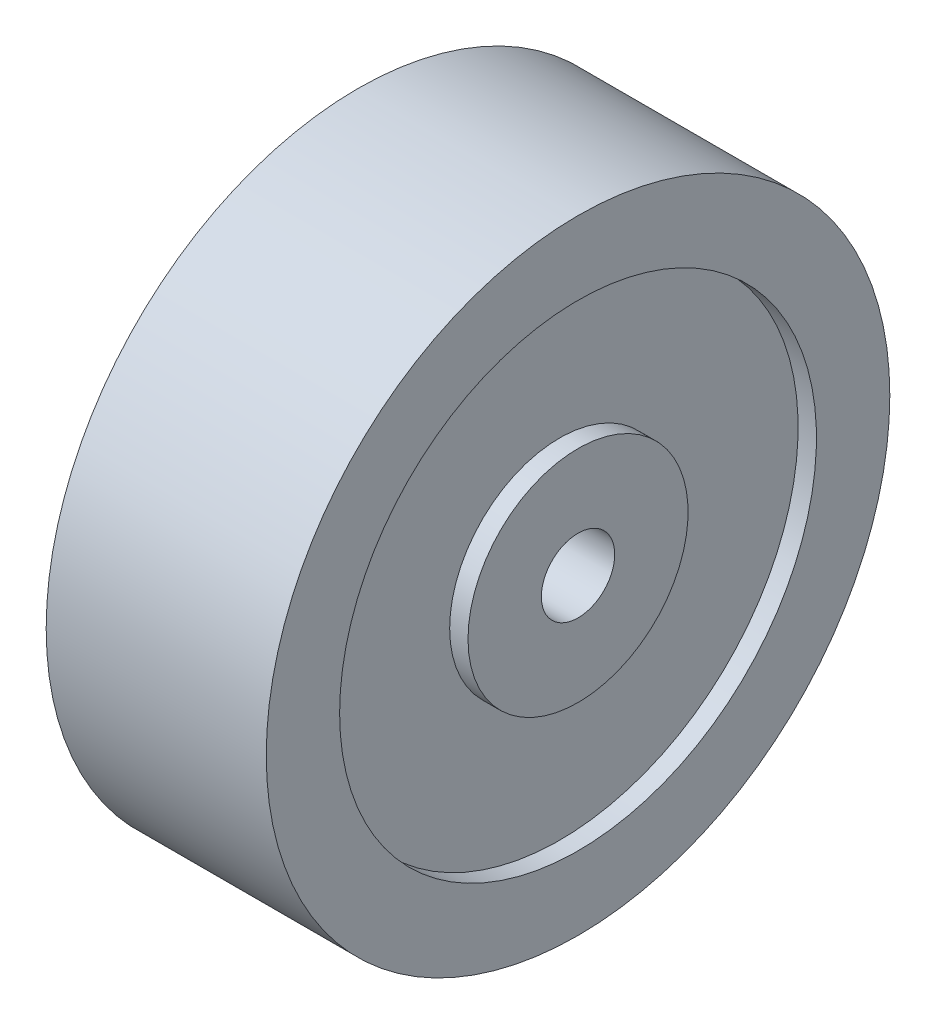
ISO-10303-21;
HEADER;
FILE_DESCRIPTION(('STEP AP214'),'2;1');
FILE_NAME('part.step','',(''),(''),'','','');
FILE_SCHEMA(('AUTOMOTIVE_DESIGN { 1 0 10303 214 1 1 1 1 }'));
ENDSEC;
DATA;
#1=APPLICATION_CONTEXT('core data for automotive mechanical design processes');
#2=APPLICATION_PROTOCOL_DEFINITION('international standard','automotive_design',2000,#1);
#3=PRODUCT_CONTEXT('',#1,'mechanical');
#4=PRODUCT('Part','Part','',(#3));
#5=PRODUCT_RELATED_PRODUCT_CATEGORY('part','',(#4));
#6=PRODUCT_DEFINITION_FORMATION('','',#4);
#7=PRODUCT_DEFINITION_CONTEXT('part definition',#1,'design');
#8=PRODUCT_DEFINITION('design','',#6,#7);
#9=PRODUCT_DEFINITION_SHAPE('','',#8);
#10=(LENGTH_UNIT() NAMED_UNIT(*) SI_UNIT(.MILLI.,.METRE.));
#11=(NAMED_UNIT(*) PLANE_ANGLE_UNIT() SI_UNIT($,.RADIAN.));
#12=(NAMED_UNIT(*) SI_UNIT($,.STERADIAN.) SOLID_ANGLE_UNIT());
#13=UNCERTAINTY_MEASURE_WITH_UNIT(LENGTH_MEASURE(1.E-05),#10,'distance_accuracy_value','');
#14=(GEOMETRIC_REPRESENTATION_CONTEXT(3) GLOBAL_UNCERTAINTY_ASSIGNED_CONTEXT((#13)) GLOBAL_UNIT_ASSIGNED_CONTEXT((#10,
#11,#12)) REPRESENTATION_CONTEXT('',''));
#15=CARTESIAN_POINT('',(0.,0.,0.));
#16=DIRECTION('',(0.,0.,1.));
#17=DIRECTION('',(1.,0.,0.));
#18=AXIS2_PLACEMENT_3D('',#15,#16,#17);
#19=CARTESIAN_POINT('',(0.,0.,0.));
#20=DIRECTION('',(-1.,0.,0.));
#21=DIRECTION('',(0.,0.,1.));
#22=AXIS2_PLACEMENT_3D('',#19,#20,#21);
#23=CYLINDRICAL_SURFACE('',#22,41.275);
#24=CARTESIAN_POINT('',(3.175,0.,0.));
#25=DIRECTION('',(-1.,0.,0.));
#26=DIRECTION('',(0.,0.,1.));
#27=AXIS2_PLACEMENT_3D('',#24,#25,#26);
#28=CIRCLE('',#27,41.275);
#29=CARTESIAN_POINT('',(3.175,0.,41.275));
#30=VERTEX_POINT('',#29);
#31=EDGE_CURVE('E74',#30,#30,#28,.T.);
#32=ORIENTED_EDGE('',*,*,#31,.F.);
#33=EDGE_LOOP('',(#32));
#34=FACE_BOUND('',#33,.T.);
#35=CARTESIAN_POINT('',(0.,0.,0.));
#36=DIRECTION('',(-1.,0.,0.));
#37=DIRECTION('',(0.,0.,1.));
#38=AXIS2_PLACEMENT_3D('',#35,#36,#37);
#39=CIRCLE('',#38,41.275);
#40=CARTESIAN_POINT('',(0.,0.,41.275));
#41=VERTEX_POINT('',#40);
#42=EDGE_CURVE('E10',#41,#41,#39,.T.);
#43=ORIENTED_EDGE('',*,*,#42,.T.);
#44=EDGE_LOOP('',(#43));
#45=FACE_BOUND('',#44,.T.);
#46=ADVANCED_FACE('F34',(#34,#45),#23,.F.);
#47=CARTESIAN_POINT('',(0.,41.275,0.));
#48=DIRECTION('',(1.,0.,0.));
#49=DIRECTION('',(0.,0.,-1.));
#50=AXIS2_PLACEMENT_3D('',#47,#48,#49);
#51=PLANE('',#50);
#52=ORIENTED_EDGE('',*,*,#42,.F.);
#53=EDGE_LOOP('',(#52));
#54=FACE_BOUND('',#53,.T.);
#55=CARTESIAN_POINT('',(0.,0.,0.));
#56=DIRECTION('',(-1.,0.,0.));
#57=DIRECTION('',(0.,0.,1.));
#58=AXIS2_PLACEMENT_3D('',#55,#56,#57);
#59=CIRCLE('',#58,53.975);
#60=CARTESIAN_POINT('',(0.,0.,53.975));
#61=VERTEX_POINT('',#60);
#62=EDGE_CURVE('E40',#61,#61,#59,.T.);
#63=ORIENTED_EDGE('',*,*,#62,.T.);
#64=EDGE_LOOP('',(#63));
#65=FACE_BOUND('',#64,.T.);
#66=ADVANCED_FACE('F81',(#54,#65),#51,.F.);
#67=CARTESIAN_POINT('',(0.,0.,0.));
#68=DIRECTION('',(-1.,0.,0.));
#69=DIRECTION('',(0.,0.,1.));
#70=AXIS2_PLACEMENT_3D('',#67,#68,#69);
#71=CYLINDRICAL_SURFACE('',#70,53.975);
#72=ORIENTED_EDGE('',*,*,#62,.F.);
#73=EDGE_LOOP('',(#72));
#74=FACE_BOUND('',#73,.T.);
#75=CARTESIAN_POINT('',(38.1,0.,0.));
#76=DIRECTION('',(-1.,0.,0.));
#77=DIRECTION('',(0.,0.,1.));
#78=AXIS2_PLACEMENT_3D('',#75,#76,#77);
#79=CIRCLE('',#78,53.975);
#80=CARTESIAN_POINT('',(38.1,0.,53.975));
#81=VERTEX_POINT('',#80);
#82=EDGE_CURVE('E44',#81,#81,#79,.T.);
#83=ORIENTED_EDGE('',*,*,#82,.T.);
#84=EDGE_LOOP('',(#83));
#85=FACE_BOUND('',#84,.T.);
#86=ADVANCED_FACE('F85',(#74,#85),#71,.T.);
#87=CARTESIAN_POINT('',(38.1,41.275,0.));
#88=DIRECTION('',(-1.,0.,0.));
#89=DIRECTION('',(0.,0.,1.));
#90=AXIS2_PLACEMENT_3D('',#87,#88,#89);
#91=PLANE('',#90);
#92=ORIENTED_EDGE('',*,*,#82,.F.);
#93=EDGE_LOOP('',(#92));
#94=FACE_BOUND('',#93,.T.);
#95=CARTESIAN_POINT('',(38.1,0.,0.));
#96=DIRECTION('',(-1.,0.,0.));
#97=DIRECTION('',(0.,0.,1.));
#98=AXIS2_PLACEMENT_3D('',#95,#96,#97);
#99=CIRCLE('',#98,41.275);
#100=CARTESIAN_POINT('',(38.1,0.,41.275));
#101=VERTEX_POINT('',#100);
#102=EDGE_CURVE('E48',#101,#101,#99,.T.);
#103=ORIENTED_EDGE('',*,*,#102,.T.);
#104=EDGE_LOOP('',(#103));
#105=FACE_BOUND('',#104,.T.);
#106=ADVANCED_FACE('F90',(#94,#105),#91,.F.);
#107=CARTESIAN_POINT('',(0.,0.,0.));
#108=DIRECTION('',(-1.,0.,0.));
#109=DIRECTION('',(0.,0.,1.));
#110=AXIS2_PLACEMENT_3D('',#107,#108,#109);
#111=CYLINDRICAL_SURFACE('',#110,41.275);
#112=ORIENTED_EDGE('',*,*,#102,.F.);
#113=EDGE_LOOP('',(#112));
#114=FACE_BOUND('',#113,.T.);
#115=CARTESIAN_POINT('',(34.925,0.,0.));
#116=DIRECTION('',(-1.,0.,0.));
#117=DIRECTION('',(0.,0.,1.));
#118=AXIS2_PLACEMENT_3D('',#115,#116,#117);
#119=CIRCLE('',#118,41.275);
#120=CARTESIAN_POINT('',(34.925,0.,41.275));
#121=VERTEX_POINT('',#120);
#122=EDGE_CURVE('E53',#121,#121,#119,.T.);
#123=ORIENTED_EDGE('',*,*,#122,.T.);
#124=EDGE_LOOP('',(#123));
#125=FACE_BOUND('',#124,.T.);
#126=ADVANCED_FACE('F96',(#114,#125),#111,.F.);
#127=CARTESIAN_POINT('',(34.925,19.05,0.));
#128=DIRECTION('',(-1.,0.,0.));
#129=DIRECTION('',(0.,0.,1.));
#130=AXIS2_PLACEMENT_3D('',#127,#128,#129);
#131=PLANE('',#130);
#132=ORIENTED_EDGE('',*,*,#122,.F.);
#133=EDGE_LOOP('',(#132));
#134=FACE_BOUND('',#133,.T.);
#135=CARTESIAN_POINT('',(34.925,0.,0.));
#136=DIRECTION('',(-1.,0.,0.));
#137=DIRECTION('',(0.,0.,1.));
#138=AXIS2_PLACEMENT_3D('',#135,#136,#137);
#139=CIRCLE('',#138,19.05);
#140=CARTESIAN_POINT('',(34.925,0.,19.05));
#141=VERTEX_POINT('',#140);
#142=EDGE_CURVE('E56',#141,#141,#139,.T.);
#143=ORIENTED_EDGE('',*,*,#142,.T.);
#144=EDGE_LOOP('',(#143));
#145=FACE_BOUND('',#144,.T.);
#146=ADVANCED_FACE('F100',(#134,#145),#131,.F.);
#147=CARTESIAN_POINT('',(0.,0.,0.));
#148=DIRECTION('',(-1.,0.,0.));
#149=DIRECTION('',(0.,0.,1.));
#150=AXIS2_PLACEMENT_3D('',#147,#148,#149);
#151=CYLINDRICAL_SURFACE('',#150,19.05);
#152=ORIENTED_EDGE('',*,*,#142,.F.);
#153=EDGE_LOOP('',(#152));
#154=FACE_BOUND('',#153,.T.);
#155=CARTESIAN_POINT('',(38.1,0.,0.));
#156=DIRECTION('',(-1.,0.,0.));
#157=DIRECTION('',(0.,0.,1.));
#158=AXIS2_PLACEMENT_3D('',#155,#156,#157);
#159=CIRCLE('',#158,19.05);
#160=CARTESIAN_POINT('',(38.1,0.,19.05));
#161=VERTEX_POINT('',#160);
#162=EDGE_CURVE('E59',#161,#161,#159,.T.);
#163=ORIENTED_EDGE('',*,*,#162,.T.);
#164=EDGE_LOOP('',(#163));
#165=FACE_BOUND('',#164,.T.);
#166=ADVANCED_FACE('F104',(#154,#165),#151,.T.);
#167=CARTESIAN_POINT('',(38.1,6.35,0.));
#168=DIRECTION('',(-1.,0.,0.));
#169=DIRECTION('',(0.,0.,1.));
#170=AXIS2_PLACEMENT_3D('',#167,#168,#169);
#171=PLANE('',#170);
#172=ORIENTED_EDGE('',*,*,#162,.F.);
#173=EDGE_LOOP('',(#172));
#174=FACE_BOUND('',#173,.T.);
#175=CARTESIAN_POINT('',(38.1,0.,0.));
#176=DIRECTION('',(-1.,0.,0.));
#177=DIRECTION('',(0.,0.,1.));
#178=AXIS2_PLACEMENT_3D('',#175,#176,#177);
#179=CIRCLE('',#178,6.35);
#180=CARTESIAN_POINT('',(38.1,0.,6.35));
#181=VERTEX_POINT('',#180);
#182=EDGE_CURVE('E62',#181,#181,#179,.T.);
#183=ORIENTED_EDGE('',*,*,#182,.T.);
#184=EDGE_LOOP('',(#183));
#185=FACE_BOUND('',#184,.T.);
#186=ADVANCED_FACE('F108',(#174,#185),#171,.F.);
#187=CARTESIAN_POINT('',(0.,0.,0.));
#188=DIRECTION('',(-1.,0.,0.));
#189=DIRECTION('',(0.,0.,1.));
#190=AXIS2_PLACEMENT_3D('',#187,#188,#189);
#191=CYLINDRICAL_SURFACE('',#190,6.35);
#192=ORIENTED_EDGE('',*,*,#182,.F.);
#193=EDGE_LOOP('',(#192));
#194=FACE_BOUND('',#193,.T.);
#195=CARTESIAN_POINT('',(0.,0.,0.));
#196=DIRECTION('',(-1.,0.,0.));
#197=DIRECTION('',(0.,0.,1.));
#198=AXIS2_PLACEMENT_3D('',#195,#196,#197);
#199=CIRCLE('',#198,6.35);
#200=CARTESIAN_POINT('',(0.,0.,6.35));
#201=VERTEX_POINT('',#200);
#202=EDGE_CURVE('E65',#201,#201,#199,.T.);
#203=ORIENTED_EDGE('',*,*,#202,.T.);
#204=EDGE_LOOP('',(#203));
#205=FACE_BOUND('',#204,.T.);
#206=ADVANCED_FACE('F112',(#194,#205),#191,.F.);
#207=CARTESIAN_POINT('',(0.,6.35,0.));
#208=DIRECTION('',(1.,0.,0.));
#209=DIRECTION('',(0.,0.,-1.));
#210=AXIS2_PLACEMENT_3D('',#207,#208,#209);
#211=PLANE('',#210);
#212=ORIENTED_EDGE('',*,*,#202,.F.);
#213=EDGE_LOOP('',(#212));
#214=FACE_BOUND('',#213,.T.);
#215=CARTESIAN_POINT('',(0.,0.,0.));
#216=DIRECTION('',(-1.,0.,0.));
#217=DIRECTION('',(0.,0.,1.));
#218=AXIS2_PLACEMENT_3D('',#215,#216,#217);
#219=CIRCLE('',#218,19.05);
#220=CARTESIAN_POINT('',(0.,0.,19.05));
#221=VERTEX_POINT('',#220);
#222=EDGE_CURVE('E68',#221,#221,#219,.T.);
#223=ORIENTED_EDGE('',*,*,#222,.T.);
#224=EDGE_LOOP('',(#223));
#225=FACE_BOUND('',#224,.T.);
#226=ADVANCED_FACE('F116',(#214,#225),#211,.F.);
#227=CARTESIAN_POINT('',(0.,0.,0.));
#228=DIRECTION('',(-1.,0.,0.));
#229=DIRECTION('',(0.,0.,1.));
#230=AXIS2_PLACEMENT_3D('',#227,#228,#229);
#231=CYLINDRICAL_SURFACE('',#230,19.05);
#232=ORIENTED_EDGE('',*,*,#222,.F.);
#233=EDGE_LOOP('',(#232));
#234=FACE_BOUND('',#233,.T.);
#235=CARTESIAN_POINT('',(3.175,0.,0.));
#236=DIRECTION('',(-1.,0.,0.));
#237=DIRECTION('',(0.,0.,1.));
#238=AXIS2_PLACEMENT_3D('',#235,#236,#237);
#239=CIRCLE('',#238,19.05);
#240=CARTESIAN_POINT('',(3.175,0.,19.05));
#241=VERTEX_POINT('',#240);
#242=EDGE_CURVE('E71',#241,#241,#239,.T.);
#243=ORIENTED_EDGE('',*,*,#242,.T.);
#244=EDGE_LOOP('',(#243));
#245=FACE_BOUND('',#244,.T.);
#246=ADVANCED_FACE('F120',(#234,#245),#231,.T.);
#247=CARTESIAN_POINT('',(3.175,19.05,0.));
#248=DIRECTION('',(1.,0.,0.));
#249=DIRECTION('',(0.,0.,-1.));
#250=AXIS2_PLACEMENT_3D('',#247,#248,#249);
#251=PLANE('',#250);
#252=ORIENTED_EDGE('',*,*,#242,.F.);
#253=EDGE_LOOP('',(#252));
#254=FACE_BOUND('',#253,.T.);
#255=ORIENTED_EDGE('',*,*,#31,.T.);
#256=EDGE_LOOP('',(#255));
#257=FACE_BOUND('',#256,.T.);
#258=ADVANCED_FACE('F78',(#254,#257),#251,.F.);
#259=CLOSED_SHELL('',(#46,#66,#86,#106,#126,#146,#166,#186,#206,#226,#246,#258));
#260=MANIFOLD_SOLID_BREP('B2',#259);
#261=ADVANCED_BREP_SHAPE_REPRESENTATION('',(#18,#260),#14);
#262=SHAPE_DEFINITION_REPRESENTATION(#9,#261);
ENDSEC;
END-ISO-10303-21;
